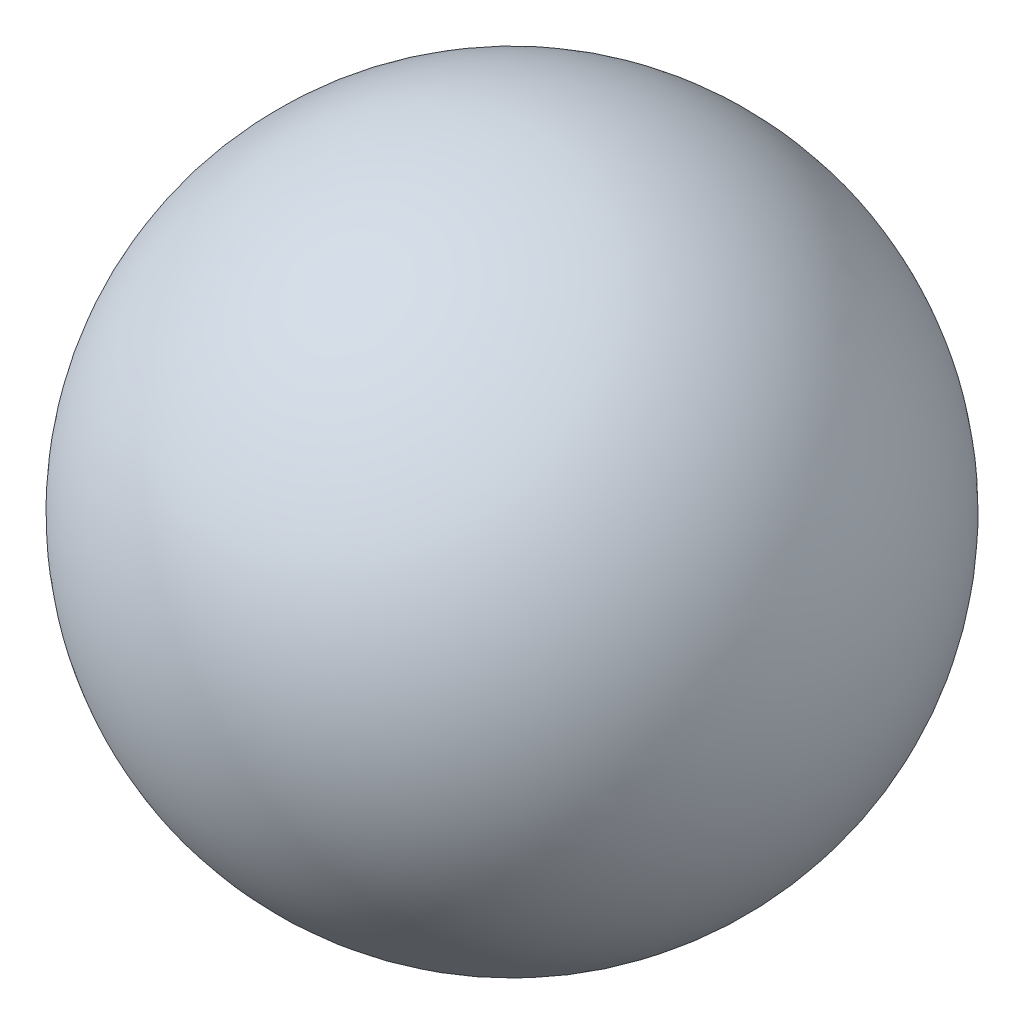
ISO-10303-21;
HEADER;
FILE_DESCRIPTION(('STEP AP214'),'2;1');
FILE_NAME('part.step','',(''),(''),'','','');
FILE_SCHEMA(('AUTOMOTIVE_DESIGN { 1 0 10303 214 1 1 1 1 }'));
ENDSEC;
DATA;
#1=APPLICATION_CONTEXT('core data for automotive mechanical design processes');
#2=APPLICATION_PROTOCOL_DEFINITION('international standard','automotive_design',2000,#1);
#3=PRODUCT_CONTEXT('',#1,'mechanical');
#4=PRODUCT('Part','Part','',(#3));
#5=PRODUCT_RELATED_PRODUCT_CATEGORY('part','',(#4));
#6=PRODUCT_DEFINITION_FORMATION('','',#4);
#7=PRODUCT_DEFINITION_CONTEXT('part definition',#1,'design');
#8=PRODUCT_DEFINITION('design','',#6,#7);
#9=PRODUCT_DEFINITION_SHAPE('','',#8);
#10=(LENGTH_UNIT() NAMED_UNIT(*) SI_UNIT(.MILLI.,.METRE.));
#11=(NAMED_UNIT(*) PLANE_ANGLE_UNIT() SI_UNIT($,.RADIAN.));
#12=(NAMED_UNIT(*) SI_UNIT($,.STERADIAN.) SOLID_ANGLE_UNIT());
#13=UNCERTAINTY_MEASURE_WITH_UNIT(LENGTH_MEASURE(1.E-05),#10,'distance_accuracy_value','');
#14=(GEOMETRIC_REPRESENTATION_CONTEXT(3) GLOBAL_UNCERTAINTY_ASSIGNED_CONTEXT((#13)) GLOBAL_UNIT_ASSIGNED_CONTEXT((#10,
#11,#12)) REPRESENTATION_CONTEXT('',''));
#15=CARTESIAN_POINT('',(0.,0.,0.));
#16=DIRECTION('',(0.,0.,1.));
#17=DIRECTION('',(1.,0.,0.));
#18=AXIS2_PLACEMENT_3D('',#15,#16,#17);
#19=CARTESIAN_POINT('',(-2.22370212123482,-2.,11.5376621928368));
#20=DIRECTION('',(0.,0.,1.));
#21=DIRECTION('',(1.,0.,0.));
#22=AXIS2_PLACEMENT_3D('',#19,#20,#21);
#23=SPHERICAL_SURFACE('',#22,1.05);
#24=CARTESIAN_POINT('',(-2.22370212123482,-2.,12.5876621928368));
#25=VERTEX_POINT('',#24);
#26=VERTEX_LOOP('',#25);
#27=FACE_BOUND('',#26,.T.);
#28=ADVANCED_FACE('F12',(#27),#23,.T.);
#29=CLOSED_SHELL('',(#28));
#30=MANIFOLD_SOLID_BREP('B1',#29);
#31=ADVANCED_BREP_SHAPE_REPRESENTATION('',(#18,#30),#14);
#32=SHAPE_DEFINITION_REPRESENTATION(#9,#31);
ENDSEC;
END-ISO-10303-21;
